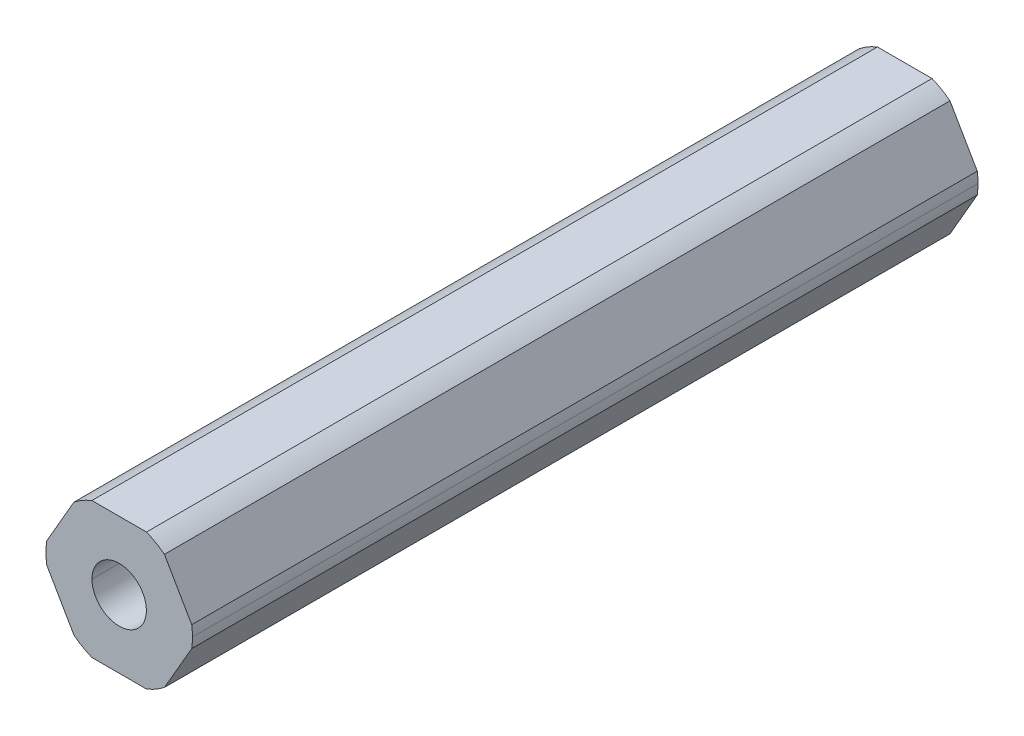
ISO-10303-21;
HEADER;
FILE_DESCRIPTION(('STEP AP214'),'2;1');
FILE_NAME('part.step','',(''),(''),'','','');
FILE_SCHEMA(('AUTOMOTIVE_DESIGN { 1 0 10303 214 1 1 1 1 }'));
ENDSEC;
DATA;
#1=APPLICATION_CONTEXT('core data for automotive mechanical design processes');
#2=APPLICATION_PROTOCOL_DEFINITION('international standard','automotive_design',2000,#1);
#3=PRODUCT_CONTEXT('',#1,'mechanical');
#4=PRODUCT('Part','Part','',(#3));
#5=PRODUCT_RELATED_PRODUCT_CATEGORY('part','',(#4));
#6=PRODUCT_DEFINITION_FORMATION('','',#4);
#7=PRODUCT_DEFINITION_CONTEXT('part definition',#1,'design');
#8=PRODUCT_DEFINITION('design','',#6,#7);
#9=PRODUCT_DEFINITION_SHAPE('','',#8);
#10=(LENGTH_UNIT() NAMED_UNIT(*) SI_UNIT(.MILLI.,.METRE.));
#11=(NAMED_UNIT(*) PLANE_ANGLE_UNIT() SI_UNIT($,.RADIAN.));
#12=(NAMED_UNIT(*) SI_UNIT($,.STERADIAN.) SOLID_ANGLE_UNIT());
#13=UNCERTAINTY_MEASURE_WITH_UNIT(LENGTH_MEASURE(1.E-05),#10,'distance_accuracy_value','');
#14=(GEOMETRIC_REPRESENTATION_CONTEXT(3) GLOBAL_UNCERTAINTY_ASSIGNED_CONTEXT((#13)) GLOBAL_UNIT_ASSIGNED_CONTEXT((#10,
#11,#12)) REPRESENTATION_CONTEXT('',''));
#15=CARTESIAN_POINT('',(0.,0.,0.));
#16=DIRECTION('',(0.,0.,1.));
#17=DIRECTION('',(1.,0.,0.));
#18=AXIS2_PLACEMENT_3D('',#15,#16,#17);
#19=CARTESIAN_POINT('',(0.,0.,-228.6));
#20=DIRECTION('',(0.,0.,1.));
#21=DIRECTION('',(1.,0.,0.));
#22=AXIS2_PLACEMENT_3D('',#19,#20,#21);
#23=CYLINDRICAL_SURFACE('',#22,2.55);
#24=CARTESIAN_POINT('',(0.,0.,-154.94));
#25=DIRECTION('',(0.,0.,1.));
#26=DIRECTION('',(1.,0.,0.));
#27=AXIS2_PLACEMENT_3D('',#24,#25,#26);
#28=CIRCLE('',#27,2.55);
#29=CARTESIAN_POINT('',(2.55,0.,-154.94));
#30=VERTEX_POINT('',#29);
#31=CARTESIAN_POINT('',(-2.55,0.,-154.94));
#32=VERTEX_POINT('',#31);
#33=EDGE_CURVE('E59',#30,#32,#28,.F.);
#34=ORIENTED_EDGE('',*,*,#33,.F.);
#35=DIRECTION('',(0.,0.,1.));
#36=VECTOR('',#35,1.);
#37=CARTESIAN_POINT('',(2.55,0.,-228.6));
#38=LINE('',#37,#36);
#39=CARTESIAN_POINT('',(2.55,0.,-228.6));
#40=VERTEX_POINT('',#39);
#41=EDGE_CURVE('E239',#40,#30,#38,.T.);
#42=ORIENTED_EDGE('',*,*,#41,.F.);
#43=CARTESIAN_POINT('',(0.,0.,-228.6));
#44=DIRECTION('',(0.,0.,1.));
#45=DIRECTION('',(1.,0.,0.));
#46=AXIS2_PLACEMENT_3D('',#43,#44,#45);
#47=CIRCLE('',#46,2.55);
#48=CARTESIAN_POINT('',(-2.55,0.,-228.6));
#49=VERTEX_POINT('',#48);
#50=EDGE_CURVE('E185',#49,#40,#47,.T.);
#51=ORIENTED_EDGE('',*,*,#50,.F.);
#52=DIRECTION('',(0.,0.,1.));
#53=VECTOR('',#52,1.);
#54=CARTESIAN_POINT('',(-2.55,0.,-228.6));
#55=LINE('',#54,#53);
#56=EDGE_CURVE('E46',#49,#32,#55,.T.);
#57=ORIENTED_EDGE('',*,*,#56,.T.);
#58=EDGE_LOOP('',(#34,#42,#51,#57));
#59=FACE_BOUND('',#58,.T.);
#60=ADVANCED_FACE('F38',(#59),#23,.F.);
#61=CARTESIAN_POINT('',(0.,0.,-228.6));
#62=DIRECTION('',(0.,0.,1.));
#63=DIRECTION('',(1.,0.,0.));
#64=AXIS2_PLACEMENT_3D('',#61,#62,#63);
#65=CYLINDRICAL_SURFACE('',#64,6.87);
#66=DIRECTION('',(0.,0.,1.));
#67=VECTOR('',#66,1.);
#68=CARTESIAN_POINT('',(6.87,0.,-228.6));
#69=LINE('',#68,#67);
#70=CARTESIAN_POINT('',(6.87,0.,-228.6));
#71=VERTEX_POINT('',#70);
#72=CARTESIAN_POINT('',(6.87,0.,-154.94));
#73=VERTEX_POINT('',#72);
#74=EDGE_CURVE('E237',#71,#73,#69,.T.);
#75=ORIENTED_EDGE('',*,*,#74,.T.);
#76=CARTESIAN_POINT('',(0.,0.,-154.94));
#77=DIRECTION('',(0.,0.,1.));
#78=DIRECTION('',(1.,0.,0.));
#79=AXIS2_PLACEMENT_3D('',#76,#77,#78);
#80=CIRCLE('',#79,6.87);
#81=CARTESIAN_POINT('',(6.80102150534208,-0.971085209378955,-154.94));
#82=VERTEX_POINT('',#81);
#83=EDGE_CURVE('E160',#82,#73,#80,.T.);
#84=ORIENTED_EDGE('',*,*,#83,.F.);
#85=DIRECTION('',(0.,0.,-1.));
#86=VECTOR('',#85,1.);
#87=CARTESIAN_POINT('',(6.80102150534208,-0.971085209378962,-228.6));
#88=LINE('',#87,#86);
#89=CARTESIAN_POINT('',(6.80102150534208,-0.971085209378955,-228.6));
#90=VERTEX_POINT('',#89);
#91=EDGE_CURVE('E235',#82,#90,#88,.T.);
#92=ORIENTED_EDGE('',*,*,#91,.T.);
#93=CARTESIAN_POINT('',(0.,0.,-228.6));
#94=DIRECTION('',(0.,0.,1.));
#95=DIRECTION('',(1.,0.,0.));
#96=AXIS2_PLACEMENT_3D('',#93,#94,#95);
#97=CIRCLE('',#96,6.87);
#98=EDGE_CURVE('E201',#90,#71,#97,.T.);
#99=ORIENTED_EDGE('',*,*,#98,.T.);
#100=EDGE_LOOP('',(#75,#84,#92,#99));
#101=FACE_BOUND('',#100,.T.);
#102=ADVANCED_FACE('F362',(#101),#65,.T.);
#103=CARTESIAN_POINT('',(3.68083890619154,-6.3754,228.6));
#104=DIRECTION('',(-0.866025403784439,0.5,0.));
#105=DIRECTION('',(0.,0.,1.));
#106=AXIS2_PLACEMENT_3D('',#103,#104,#105);
#107=PLANE('',#106);
#108=DIRECTION('',(0.500000000000001,0.866025403784438,0.));
#109=VECTOR('',#108,1.);
#110=CARTESIAN_POINT('',(4.24149521323254,-5.40431479062105,-154.94));
#111=LINE('',#110,#109);
#112=CARTESIAN_POINT('',(4.24149521323254,-5.40431479062105,-154.94));
#113=VERTEX_POINT('',#112);
#114=EDGE_CURVE('E305',#113,#82,#111,.T.);
#115=ORIENTED_EDGE('',*,*,#114,.F.);
#116=DIRECTION('',(0.,0.,1.));
#117=VECTOR('',#116,1.);
#118=CARTESIAN_POINT('',(4.24149521323255,-5.40431479062104,-228.6));
#119=LINE('',#118,#117);
#120=CARTESIAN_POINT('',(4.24149521323254,-5.40431479062105,-228.6));
#121=VERTEX_POINT('',#120);
#122=EDGE_CURVE('E179',#121,#113,#119,.T.);
#123=ORIENTED_EDGE('',*,*,#122,.F.);
#124=DIRECTION('',(0.5,0.866025403784439,0.));
#125=VECTOR('',#124,1.);
#126=CARTESIAN_POINT('',(3.68083890619154,-6.3754,-228.6));
#127=LINE('',#126,#125);
#128=EDGE_CURVE('E238',#121,#90,#127,.T.);
#129=ORIENTED_EDGE('',*,*,#128,.T.);
#130=ORIENTED_EDGE('',*,*,#91,.F.);
#131=EDGE_LOOP('',(#115,#123,#129,#130));
#132=FACE_BOUND('',#131,.T.);
#133=ADVANCED_FACE('F332',(#132),#107,.F.);
#134=CARTESIAN_POINT('',(7.36167781238308,0.,228.6));
#135=DIRECTION('',(-0.866025403784439,-0.5,0.));
#136=DIRECTION('',(-0.5,0.866025403784439,0.));
#137=AXIS2_PLACEMENT_3D('',#134,#135,#136);
#138=PLANE('',#137);
#139=DIRECTION('',(-0.5,0.866025403784438,0.));
#140=VECTOR('',#139,1.);
#141=CARTESIAN_POINT('',(6.80102150534208,0.97108520937895,-154.94));
#142=LINE('',#141,#140);
#143=CARTESIAN_POINT('',(6.80102150534208,0.97108520937895,-154.94));
#144=VERTEX_POINT('',#143);
#145=CARTESIAN_POINT('',(4.24149521323254,5.40431479062105,-154.94));
#146=VERTEX_POINT('',#145);
#147=EDGE_CURVE('E53',#144,#146,#142,.T.);
#148=ORIENTED_EDGE('',*,*,#147,.F.);
#149=DIRECTION('',(0.,0.,1.));
#150=VECTOR('',#149,1.);
#151=CARTESIAN_POINT('',(6.80102150534208,0.971085209378949,-228.6));
#152=LINE('',#151,#150);
#153=CARTESIAN_POINT('',(6.80102150534208,0.97108520937895,-228.6));
#154=VERTEX_POINT('',#153);
#155=EDGE_CURVE('E169',#154,#144,#152,.T.);
#156=ORIENTED_EDGE('',*,*,#155,.F.);
#157=DIRECTION('',(-0.5,0.866025403784439,0.));
#158=VECTOR('',#157,1.);
#159=CARTESIAN_POINT('',(7.36167781238308,0.,-228.6));
#160=LINE('',#159,#158);
#161=CARTESIAN_POINT('',(4.24149521323254,5.40431479062105,-228.6));
#162=VERTEX_POINT('',#161);
#163=EDGE_CURVE('E206',#154,#162,#160,.T.);
#164=ORIENTED_EDGE('',*,*,#163,.T.);
#165=DIRECTION('',(0.,0.,-1.));
#166=VECTOR('',#165,1.);
#167=CARTESIAN_POINT('',(4.24149521323254,5.40431479062105,-228.6));
#168=LINE('',#167,#166);
#169=EDGE_CURVE('E171',#146,#162,#168,.T.);
#170=ORIENTED_EDGE('',*,*,#169,.F.);
#171=EDGE_LOOP('',(#148,#156,#164,#170));
#172=FACE_BOUND('',#171,.T.);
#173=ADVANCED_FACE('F167',(#172),#138,.F.);
#174=CARTESIAN_POINT('',(3.68083890619154,6.3754,228.6));
#175=DIRECTION('',(0.,-1.,0.));
#176=DIRECTION('',(0.,0.,-1.));
#177=AXIS2_PLACEMENT_3D('',#174,#175,#176);
#178=PLANE('',#177);
#179=DIRECTION('',(-1.,0.,0.));
#180=VECTOR('',#179,1.);
#181=CARTESIAN_POINT('',(2.55952629210953,6.3754,-154.94));
#182=LINE('',#181,#180);
#183=CARTESIAN_POINT('',(2.55952629210953,6.3754,-154.94));
#184=VERTEX_POINT('',#183);
#185=CARTESIAN_POINT('',(-2.55952629210953,6.3754,-154.94));
#186=VERTEX_POINT('',#185);
#187=EDGE_CURVE('E319',#184,#186,#182,.T.);
#188=ORIENTED_EDGE('',*,*,#187,.F.);
#189=DIRECTION('',(0.,0.,1.));
#190=VECTOR('',#189,1.);
#191=CARTESIAN_POINT('',(2.55952629210952,6.3754,-228.6));
#192=LINE('',#191,#190);
#193=CARTESIAN_POINT('',(2.55952629210952,6.3754,-228.6));
#194=VERTEX_POINT('',#193);
#195=EDGE_CURVE('E243',#194,#184,#192,.T.);
#196=ORIENTED_EDGE('',*,*,#195,.F.);
#197=DIRECTION('',(-1.,0.,0.));
#198=VECTOR('',#197,1.);
#199=CARTESIAN_POINT('',(3.68083890619154,6.3754,-228.6));
#200=LINE('',#199,#198);
#201=CARTESIAN_POINT('',(-2.55952629210953,6.3754,-228.6));
#202=VERTEX_POINT('',#201);
#203=EDGE_CURVE('E202',#194,#202,#200,.T.);
#204=ORIENTED_EDGE('',*,*,#203,.T.);
#205=DIRECTION('',(0.,0.,-1.));
#206=VECTOR('',#205,1.);
#207=CARTESIAN_POINT('',(-2.55952629210953,6.3754,-228.6));
#208=LINE('',#207,#206);
#209=EDGE_CURVE('E230',#186,#202,#208,.T.);
#210=ORIENTED_EDGE('',*,*,#209,.F.);
#211=EDGE_LOOP('',(#188,#196,#204,#210));
#212=FACE_BOUND('',#211,.T.);
#213=ADVANCED_FACE('F323',(#212),#178,.F.);
#214=CARTESIAN_POINT('',(-3.68083890619154,6.3754,228.6));
#215=DIRECTION('',(0.866025403784439,-0.5,0.));
#216=DIRECTION('',(0.,0.,-1.));
#217=AXIS2_PLACEMENT_3D('',#214,#215,#216);
#218=PLANE('',#217);
#219=DIRECTION('',(-0.5,-0.866025403784438,0.));
#220=VECTOR('',#219,1.);
#221=CARTESIAN_POINT('',(-4.24149521323255,5.40431479062105,-154.94));
#222=LINE('',#221,#220);
#223=CARTESIAN_POINT('',(-4.24149521323254,5.40431479062105,-154.94));
#224=VERTEX_POINT('',#223);
#225=CARTESIAN_POINT('',(-6.80102150534208,0.97108520937896,-154.94));
#226=VERTEX_POINT('',#225);
#227=EDGE_CURVE('E290',#224,#226,#222,.T.);
#228=ORIENTED_EDGE('',*,*,#227,.F.);
#229=DIRECTION('',(0.,0.,1.));
#230=VECTOR('',#229,1.);
#231=CARTESIAN_POINT('',(-4.24149521323255,5.40431479062105,-228.6));
#232=LINE('',#231,#230);
#233=CARTESIAN_POINT('',(-4.24149521323255,5.40431479062105,-228.6));
#234=VERTEX_POINT('',#233);
#235=EDGE_CURVE('E257',#234,#224,#232,.T.);
#236=ORIENTED_EDGE('',*,*,#235,.F.);
#237=DIRECTION('',(-0.5,-0.866025403784439,0.));
#238=VECTOR('',#237,1.);
#239=CARTESIAN_POINT('',(-3.68083890619154,6.3754,-228.6));
#240=LINE('',#239,#238);
#241=CARTESIAN_POINT('',(-6.80102150534208,0.97108520937896,-228.6));
#242=VERTEX_POINT('',#241);
#243=EDGE_CURVE('E207',#234,#242,#240,.T.);
#244=ORIENTED_EDGE('',*,*,#243,.T.);
#245=DIRECTION('',(0.,0.,-1.));
#246=VECTOR('',#245,1.);
#247=CARTESIAN_POINT('',(-6.80102150534208,0.97108520937896,-228.6));
#248=LINE('',#247,#246);
#249=EDGE_CURVE('E208',#226,#242,#248,.T.);
#250=ORIENTED_EDGE('',*,*,#249,.F.);
#251=EDGE_LOOP('',(#228,#236,#244,#250));
#252=FACE_BOUND('',#251,.T.);
#253=ADVANCED_FACE('F287',(#252),#218,.F.);
#254=CARTESIAN_POINT('',(-7.36167781238308,0.,228.6));
#255=DIRECTION('',(0.866025403784439,0.5,0.));
#256=DIRECTION('',(0.,0.,-1.));
#257=AXIS2_PLACEMENT_3D('',#254,#255,#256);
#258=PLANE('',#257);
#259=DIRECTION('',(0.5,-0.866025403784439,0.));
#260=VECTOR('',#259,1.);
#261=CARTESIAN_POINT('',(-6.80102150534208,-0.971085209378954,-154.94));
#262=LINE('',#261,#260);
#263=CARTESIAN_POINT('',(-6.80102150534208,-0.971085209378951,-154.94));
#264=VERTEX_POINT('',#263);
#265=CARTESIAN_POINT('',(-4.24149521323254,-5.40431479062105,-154.94));
#266=VERTEX_POINT('',#265);
#267=EDGE_CURVE('E313',#264,#266,#262,.T.);
#268=ORIENTED_EDGE('',*,*,#267,.F.);
#269=DIRECTION('',(0.,0.,1.));
#270=VECTOR('',#269,1.);
#271=CARTESIAN_POINT('',(-6.80102150534208,-0.971085209378962,-228.6));
#272=LINE('',#271,#270);
#273=CARTESIAN_POINT('',(-6.80102150534208,-0.971085209378956,-228.6));
#274=VERTEX_POINT('',#273);
#275=EDGE_CURVE('E226',#274,#264,#272,.T.);
#276=ORIENTED_EDGE('',*,*,#275,.F.);
#277=DIRECTION('',(0.5,-0.866025403784439,0.));
#278=VECTOR('',#277,1.);
#279=CARTESIAN_POINT('',(-7.36167781238308,0.,-228.6));
#280=LINE('',#279,#278);
#281=CARTESIAN_POINT('',(-4.24149521323254,-5.40431479062105,-228.6));
#282=VERTEX_POINT('',#281);
#283=EDGE_CURVE('E221',#274,#282,#280,.T.);
#284=ORIENTED_EDGE('',*,*,#283,.T.);
#285=DIRECTION('',(0.,0.,-1.));
#286=VECTOR('',#285,1.);
#287=CARTESIAN_POINT('',(-4.24149521323255,-5.40431479062104,-228.6));
#288=LINE('',#287,#286);
#289=EDGE_CURVE('E216',#266,#282,#288,.T.);
#290=ORIENTED_EDGE('',*,*,#289,.F.);
#291=EDGE_LOOP('',(#268,#276,#284,#290));
#292=FACE_BOUND('',#291,.T.);
#293=ADVANCED_FACE('F346',(#292),#258,.F.);
#294=CARTESIAN_POINT('',(-3.68083890619154,-6.3754,228.6));
#295=DIRECTION('',(0.,1.,0.));
#296=DIRECTION('',(1.,0.,0.));
#297=AXIS2_PLACEMENT_3D('',#294,#295,#296);
#298=PLANE('',#297);
#299=DIRECTION('',(1.,0.,0.));
#300=VECTOR('',#299,1.);
#301=CARTESIAN_POINT('',(-2.55952629210953,-6.3754,-154.94));
#302=LINE('',#301,#300);
#303=CARTESIAN_POINT('',(-2.55952629210953,-6.3754,-154.94));
#304=VERTEX_POINT('',#303);
#305=CARTESIAN_POINT('',(2.55952629210953,-6.3754,-154.94));
#306=VERTEX_POINT('',#305);
#307=EDGE_CURVE('E309',#304,#306,#302,.T.);
#308=ORIENTED_EDGE('',*,*,#307,.F.);
#309=DIRECTION('',(0.,0.,1.));
#310=VECTOR('',#309,1.);
#311=CARTESIAN_POINT('',(-2.55952629210953,-6.3754,-228.6));
#312=LINE('',#311,#310);
#313=CARTESIAN_POINT('',(-2.55952629210953,-6.3754,-228.6));
#314=VERTEX_POINT('',#313);
#315=EDGE_CURVE('E209',#314,#304,#312,.T.);
#316=ORIENTED_EDGE('',*,*,#315,.F.);
#317=DIRECTION('',(1.,0.,0.));
#318=VECTOR('',#317,1.);
#319=CARTESIAN_POINT('',(-3.68083890619154,-6.3754,-228.6));
#320=LINE('',#319,#318);
#321=CARTESIAN_POINT('',(2.55952629210953,-6.3754,-228.6));
#322=VERTEX_POINT('',#321);
#323=EDGE_CURVE('E217',#314,#322,#320,.T.);
#324=ORIENTED_EDGE('',*,*,#323,.T.);
#325=DIRECTION('',(0.,0.,-1.));
#326=VECTOR('',#325,1.);
#327=CARTESIAN_POINT('',(2.55952629210953,-6.3754,-228.6));
#328=LINE('',#327,#326);
#329=EDGE_CURVE('E189',#306,#322,#328,.T.);
#330=ORIENTED_EDGE('',*,*,#329,.F.);
#331=EDGE_LOOP('',(#308,#316,#324,#330));
#332=FACE_BOUND('',#331,.T.);
#333=ADVANCED_FACE('F350',(#332),#298,.F.);
#334=CARTESIAN_POINT('',(0.,0.,-228.6));
#335=DIRECTION('',(0.,0.,1.));
#336=DIRECTION('',(1.,0.,0.));
#337=AXIS2_PLACEMENT_3D('',#334,#335,#336);
#338=CYLINDRICAL_SURFACE('',#337,6.87);
#339=ORIENTED_EDGE('',*,*,#155,.T.);
#340=EDGE_CURVE('E157',#73,#144,#80,.T.);
#341=ORIENTED_EDGE('',*,*,#340,.F.);
#342=ORIENTED_EDGE('',*,*,#74,.F.);
#343=CARTESIAN_POINT('',(0.,0.,-228.6));
#344=DIRECTION('',(0.,0.,1.));
#345=DIRECTION('',(1.,0.,0.));
#346=AXIS2_PLACEMENT_3D('',#343,#344,#345);
#347=CIRCLE('',#346,6.87);
#348=EDGE_CURVE('E177',#71,#154,#347,.T.);
#349=ORIENTED_EDGE('',*,*,#348,.T.);
#350=EDGE_LOOP('',(#339,#341,#342,#349));
#351=FACE_BOUND('',#350,.T.);
#352=ADVANCED_FACE('F175',(#351),#338,.T.);
#353=CARTESIAN_POINT('',(0.,0.,-228.6));
#354=DIRECTION('',(0.,0.,1.));
#355=DIRECTION('',(1.,0.,0.));
#356=AXIS2_PLACEMENT_3D('',#353,#354,#355);
#357=CYLINDRICAL_SURFACE('',#356,6.87);
#358=ORIENTED_EDGE('',*,*,#122,.T.);
#359=CARTESIAN_POINT('',(0.,0.,-154.94));
#360=DIRECTION('',(0.,0.,1.));
#361=DIRECTION('',(1.,0.,0.));
#362=AXIS2_PLACEMENT_3D('',#359,#360,#361);
#363=CIRCLE('',#362,6.87);
#364=EDGE_CURVE('E307',#306,#113,#363,.T.);
#365=ORIENTED_EDGE('',*,*,#364,.F.);
#366=ORIENTED_EDGE('',*,*,#329,.T.);
#367=CARTESIAN_POINT('',(0.,0.,-228.6));
#368=DIRECTION('',(0.,0.,1.));
#369=DIRECTION('',(1.,0.,0.));
#370=AXIS2_PLACEMENT_3D('',#367,#368,#369);
#371=CIRCLE('',#370,6.87);
#372=EDGE_CURVE('E193',#322,#121,#371,.T.);
#373=ORIENTED_EDGE('',*,*,#372,.T.);
#374=EDGE_LOOP('',(#358,#365,#366,#373));
#375=FACE_BOUND('',#374,.T.);
#376=ADVANCED_FACE('F335',(#375),#357,.T.);
#377=CARTESIAN_POINT('',(0.,0.,-228.6));
#378=DIRECTION('',(0.,0.,1.));
#379=DIRECTION('',(1.,0.,0.));
#380=AXIS2_PLACEMENT_3D('',#377,#378,#379);
#381=CYLINDRICAL_SURFACE('',#380,6.87);
#382=ORIENTED_EDGE('',*,*,#315,.T.);
#383=CARTESIAN_POINT('',(0.,0.,-154.94));
#384=DIRECTION('',(0.,0.,1.));
#385=DIRECTION('',(1.,0.,0.));
#386=AXIS2_PLACEMENT_3D('',#383,#384,#385);
#387=CIRCLE('',#386,6.87);
#388=EDGE_CURVE('E311',#266,#304,#387,.T.);
#389=ORIENTED_EDGE('',*,*,#388,.F.);
#390=ORIENTED_EDGE('',*,*,#289,.T.);
#391=CARTESIAN_POINT('',(0.,0.,-228.6));
#392=DIRECTION('',(0.,0.,1.));
#393=DIRECTION('',(1.,0.,0.));
#394=AXIS2_PLACEMENT_3D('',#391,#392,#393);
#395=CIRCLE('',#394,6.87);
#396=EDGE_CURVE('E212',#282,#314,#395,.T.);
#397=ORIENTED_EDGE('',*,*,#396,.T.);
#398=EDGE_LOOP('',(#382,#389,#390,#397));
#399=FACE_BOUND('',#398,.T.);
#400=ADVANCED_FACE('F341',(#399),#381,.T.);
#401=CARTESIAN_POINT('',(0.,0.,-228.6));
#402=DIRECTION('',(0.,0.,1.));
#403=DIRECTION('',(1.,0.,0.));
#404=AXIS2_PLACEMENT_3D('',#401,#402,#403);
#405=CYLINDRICAL_SURFACE('',#404,6.87);
#406=ORIENTED_EDGE('',*,*,#275,.T.);
#407=CARTESIAN_POINT('',(0.,0.,-154.94));
#408=DIRECTION('',(0.,0.,1.));
#409=DIRECTION('',(1.,0.,0.));
#410=AXIS2_PLACEMENT_3D('',#407,#408,#409);
#411=CIRCLE('',#410,6.87);
#412=EDGE_CURVE('E315',#226,#264,#411,.T.);
#413=ORIENTED_EDGE('',*,*,#412,.F.);
#414=ORIENTED_EDGE('',*,*,#249,.T.);
#415=CARTESIAN_POINT('',(0.,0.,-228.6));
#416=DIRECTION('',(0.,0.,1.));
#417=DIRECTION('',(1.,0.,0.));
#418=AXIS2_PLACEMENT_3D('',#415,#416,#417);
#419=CIRCLE('',#418,6.87);
#420=EDGE_CURVE('E210',#242,#274,#419,.T.);
#421=ORIENTED_EDGE('',*,*,#420,.T.);
#422=EDGE_LOOP('',(#406,#413,#414,#421));
#423=FACE_BOUND('',#422,.T.);
#424=ADVANCED_FACE('F348',(#423),#405,.T.);
#425=CARTESIAN_POINT('',(0.,0.,-228.6));
#426=DIRECTION('',(0.,0.,1.));
#427=DIRECTION('',(1.,0.,0.));
#428=AXIS2_PLACEMENT_3D('',#425,#426,#427);
#429=CYLINDRICAL_SURFACE('',#428,6.87);
#430=ORIENTED_EDGE('',*,*,#235,.T.);
#431=CARTESIAN_POINT('',(0.,0.,-154.94));
#432=DIRECTION('',(0.,0.,1.));
#433=DIRECTION('',(1.,0.,0.));
#434=AXIS2_PLACEMENT_3D('',#431,#432,#433);
#435=CIRCLE('',#434,6.87);
#436=EDGE_CURVE('E281',#186,#224,#435,.T.);
#437=ORIENTED_EDGE('',*,*,#436,.F.);
#438=ORIENTED_EDGE('',*,*,#209,.T.);
#439=CARTESIAN_POINT('',(0.,0.,-228.6));
#440=DIRECTION('',(0.,0.,1.));
#441=DIRECTION('',(1.,0.,0.));
#442=AXIS2_PLACEMENT_3D('',#439,#440,#441);
#443=CIRCLE('',#442,6.87);
#444=EDGE_CURVE('E253',#202,#234,#443,.T.);
#445=ORIENTED_EDGE('',*,*,#444,.T.);
#446=EDGE_LOOP('',(#430,#437,#438,#445));
#447=FACE_BOUND('',#446,.T.);
#448=ADVANCED_FACE('F280',(#447),#429,.T.);
#449=CARTESIAN_POINT('',(0.,0.,-228.6));
#450=DIRECTION('',(0.,0.,1.));
#451=DIRECTION('',(1.,0.,0.));
#452=AXIS2_PLACEMENT_3D('',#449,#450,#451);
#453=CYLINDRICAL_SURFACE('',#452,6.87);
#454=ORIENTED_EDGE('',*,*,#195,.T.);
#455=CARTESIAN_POINT('',(0.,0.,-154.94));
#456=DIRECTION('',(0.,0.,1.));
#457=DIRECTION('',(1.,0.,0.));
#458=AXIS2_PLACEMENT_3D('',#455,#456,#457);
#459=CIRCLE('',#458,6.87);
#460=EDGE_CURVE('E172',#146,#184,#459,.T.);
#461=ORIENTED_EDGE('',*,*,#460,.F.);
#462=ORIENTED_EDGE('',*,*,#169,.T.);
#463=CARTESIAN_POINT('',(0.,0.,-228.6));
#464=DIRECTION('',(0.,0.,1.));
#465=DIRECTION('',(1.,0.,0.));
#466=AXIS2_PLACEMENT_3D('',#463,#464,#465);
#467=CIRCLE('',#466,6.87);
#468=EDGE_CURVE('E259',#162,#194,#467,.T.);
#469=ORIENTED_EDGE('',*,*,#468,.T.);
#470=EDGE_LOOP('',(#454,#461,#462,#469));
#471=FACE_BOUND('',#470,.T.);
#472=ADVANCED_FACE('F374',(#471),#453,.T.);
#473=CARTESIAN_POINT('',(0.,0.,-228.6));
#474=DIRECTION('',(0.,0.,1.));
#475=DIRECTION('',(1.,0.,0.));
#476=AXIS2_PLACEMENT_3D('',#473,#474,#475);
#477=CYLINDRICAL_SURFACE('',#476,2.55);
#478=CARTESIAN_POINT('',(0.,0.,-154.94));
#479=DIRECTION('',(0.,0.,1.));
#480=DIRECTION('',(1.,0.,0.));
#481=AXIS2_PLACEMENT_3D('',#478,#479,#480);
#482=CIRCLE('',#481,2.55);
#483=EDGE_CURVE('E11',#32,#30,#482,.F.);
#484=ORIENTED_EDGE('',*,*,#483,.F.);
#485=ORIENTED_EDGE('',*,*,#56,.F.);
#486=CARTESIAN_POINT('',(0.,0.,-228.6));
#487=DIRECTION('',(0.,0.,1.));
#488=DIRECTION('',(1.,0.,0.));
#489=AXIS2_PLACEMENT_3D('',#486,#487,#488);
#490=CIRCLE('',#489,2.55);
#491=EDGE_CURVE('E197',#40,#49,#490,.T.);
#492=ORIENTED_EDGE('',*,*,#491,.F.);
#493=ORIENTED_EDGE('',*,*,#41,.T.);
#494=EDGE_LOOP('',(#484,#485,#492,#493));
#495=FACE_BOUND('',#494,.T.);
#496=ADVANCED_FACE('F375',(#495),#477,.F.);
#497=CARTESIAN_POINT('',(0.,0.,-228.6));
#498=DIRECTION('',(0.,0.,1.));
#499=DIRECTION('',(1.,0.,0.));
#500=AXIS2_PLACEMENT_3D('',#497,#498,#499);
#501=PLANE('',#500);
#502=ORIENTED_EDGE('',*,*,#468,.F.);
#503=ORIENTED_EDGE('',*,*,#163,.F.);
#504=ORIENTED_EDGE('',*,*,#348,.F.);
#505=ORIENTED_EDGE('',*,*,#98,.F.);
#506=ORIENTED_EDGE('',*,*,#128,.F.);
#507=ORIENTED_EDGE('',*,*,#372,.F.);
#508=ORIENTED_EDGE('',*,*,#323,.F.);
#509=ORIENTED_EDGE('',*,*,#396,.F.);
#510=ORIENTED_EDGE('',*,*,#283,.F.);
#511=ORIENTED_EDGE('',*,*,#420,.F.);
#512=ORIENTED_EDGE('',*,*,#243,.F.);
#513=ORIENTED_EDGE('',*,*,#444,.F.);
#514=ORIENTED_EDGE('',*,*,#203,.F.);
#515=EDGE_LOOP('',(#502,#503,#504,#505,#506,#507,#508,#509,#510,#511,#512,#513,#514));
#516=FACE_BOUND('',#515,.T.);
#517=ORIENTED_EDGE('',*,*,#491,.T.);
#518=ORIENTED_EDGE('',*,*,#50,.T.);
#519=EDGE_LOOP('',(#517,#518));
#520=FACE_BOUND('',#519,.T.);
#521=ADVANCED_FACE('F40',(#516,#520),#501,.F.);
#522=CARTESIAN_POINT('',(0.,0.,-154.94));
#523=DIRECTION('',(0.,0.,1.));
#524=DIRECTION('',(1.,0.,0.));
#525=AXIS2_PLACEMENT_3D('',#522,#523,#524);
#526=PLANE('',#525);
#527=ORIENTED_EDGE('',*,*,#83,.T.);
#528=ORIENTED_EDGE('',*,*,#340,.T.);
#529=ORIENTED_EDGE('',*,*,#147,.T.);
#530=ORIENTED_EDGE('',*,*,#460,.T.);
#531=ORIENTED_EDGE('',*,*,#187,.T.);
#532=ORIENTED_EDGE('',*,*,#436,.T.);
#533=ORIENTED_EDGE('',*,*,#227,.T.);
#534=ORIENTED_EDGE('',*,*,#412,.T.);
#535=ORIENTED_EDGE('',*,*,#267,.T.);
#536=ORIENTED_EDGE('',*,*,#388,.T.);
#537=ORIENTED_EDGE('',*,*,#307,.T.);
#538=ORIENTED_EDGE('',*,*,#364,.T.);
#539=ORIENTED_EDGE('',*,*,#114,.T.);
#540=EDGE_LOOP('',(#527,#528,#529,#530,#531,#532,#533,#534,#535,#536,#537,#538,#539));
#541=FACE_BOUND('',#540,.T.);
#542=ORIENTED_EDGE('',*,*,#33,.T.);
#543=ORIENTED_EDGE('',*,*,#483,.T.);
#544=EDGE_LOOP('',(#542,#543));
#545=FACE_BOUND('',#544,.T.);
#546=ADVANCED_FACE('F158',(#541,#545),#526,.T.);
#547=CLOSED_SHELL('',(#60,#102,#133,#173,#213,#253,#293,#333,#352,#376,#400,#424,#448,#472,#496,
#521,#546));
#548=MANIFOLD_SOLID_BREP('B2',#547);
#549=ADVANCED_BREP_SHAPE_REPRESENTATION('',(#18,#548),#14);
#550=SHAPE_DEFINITION_REPRESENTATION(#9,#549);
ENDSEC;
END-ISO-10303-21;
